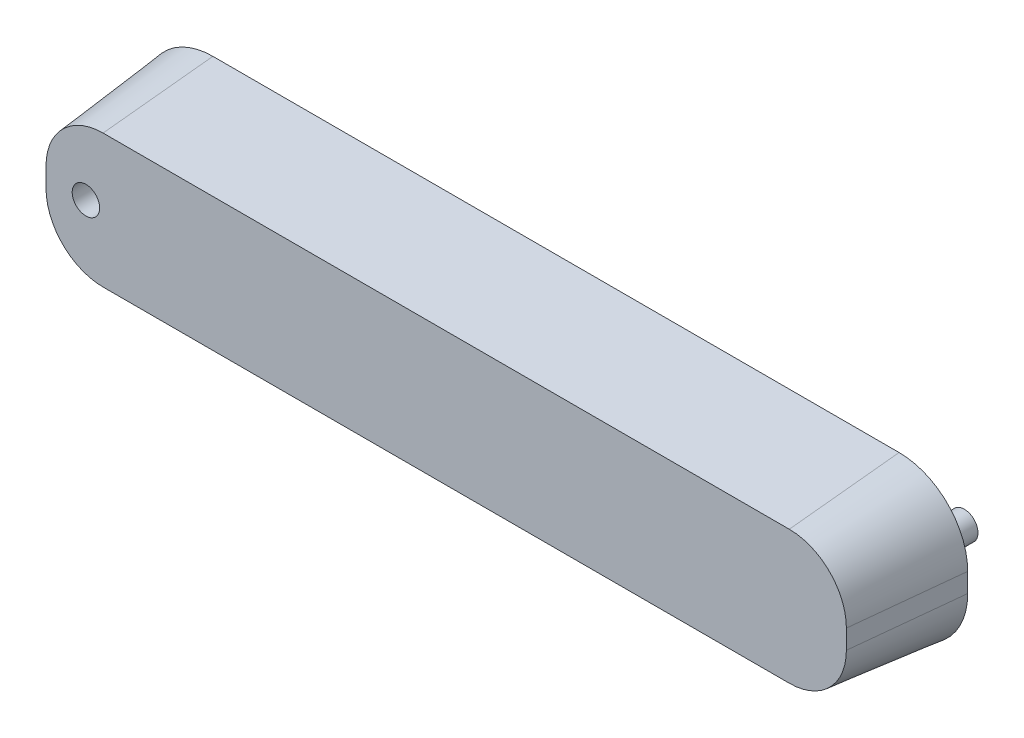
ISO-10303-21;
HEADER;
FILE_DESCRIPTION(('STEP AP214'),'2;1');
FILE_NAME('part.step','',(''),(''),'','','');
FILE_SCHEMA(('AUTOMOTIVE_DESIGN { 1 0 10303 214 1 1 1 1 }'));
ENDSEC;
DATA;
#1=APPLICATION_CONTEXT('core data for automotive mechanical design processes');
#2=APPLICATION_PROTOCOL_DEFINITION('international standard','automotive_design',2000,#1);
#3=PRODUCT_CONTEXT('',#1,'mechanical');
#4=PRODUCT('Part','Part','',(#3));
#5=PRODUCT_RELATED_PRODUCT_CATEGORY('part','',(#4));
#6=PRODUCT_DEFINITION_FORMATION('','',#4);
#7=PRODUCT_DEFINITION_CONTEXT('part definition',#1,'design');
#8=PRODUCT_DEFINITION('design','',#6,#7);
#9=PRODUCT_DEFINITION_SHAPE('','',#8);
#10=(LENGTH_UNIT() NAMED_UNIT(*) SI_UNIT(.MILLI.,.METRE.));
#11=(NAMED_UNIT(*) PLANE_ANGLE_UNIT() SI_UNIT($,.RADIAN.));
#12=(NAMED_UNIT(*) SI_UNIT($,.STERADIAN.) SOLID_ANGLE_UNIT());
#13=UNCERTAINTY_MEASURE_WITH_UNIT(LENGTH_MEASURE(1.E-05),#10,'distance_accuracy_value','');
#14=(GEOMETRIC_REPRESENTATION_CONTEXT(3) GLOBAL_UNCERTAINTY_ASSIGNED_CONTEXT((#13)) GLOBAL_UNIT_ASSIGNED_CONTEXT((#10,
#11,#12)) REPRESENTATION_CONTEXT('',''));
#15=CARTESIAN_POINT('',(0.,0.,0.));
#16=DIRECTION('',(0.,0.,1.));
#17=DIRECTION('',(1.,0.,0.));
#18=AXIS2_PLACEMENT_3D('',#15,#16,#17);
#19=CARTESIAN_POINT('',(12.5000000000005,6.99999999999983,0.));
#20=DIRECTION('',(0.,0.,-1.));
#21=DIRECTION('',(0.,-1.,0.));
#22=AXIS2_PLACEMENT_3D('',#19,#20,#21);
#23=CONICAL_SURFACE('',#22,50.,0.10471975511966);
#24=CARTESIAN_POINT('',(12.5000000000005,6.99999999999983,0.));
#25=DIRECTION('',(0.,0.,1.));
#26=DIRECTION('',(0.,-1.,0.));
#27=AXIS2_PLACEMENT_3D('',#24,#25,#26);
#28=CIRCLE('',#27,50.);
#29=CARTESIAN_POINT('',(12.5000000000008,56.9999999999998,1.99014436314058E-13));
#30=VERTEX_POINT('',#29);
#31=CARTESIAN_POINT('',(-37.4999999999995,6.99999999999938,0.));
#32=VERTEX_POINT('',#31);
#33=EDGE_CURVE('E107',#30,#32,#28,.T.);
#34=ORIENTED_EDGE('',*,*,#33,.T.);
#35=DIRECTION('',(-0.104528463267653,0.,-0.994521895368273));
#36=VECTOR('',#35,1.);
#37=CARTESIAN_POINT('',(-37.4999999999995,6.99999999999938,0.));
#38=LINE('',#37,#36);
#39=CARTESIAN_POINT('',(-29.0916611787453,6.9999999999991,80.));
#40=VERTEX_POINT('',#39);
#41=EDGE_CURVE('E42',#40,#32,#38,.T.);
#42=ORIENTED_EDGE('',*,*,#41,.F.);
#43=CARTESIAN_POINT('',(12.5000000000005,6.99999999999955,80.));
#44=DIRECTION('',(0.,0.,1.));
#45=DIRECTION('',(0.,-1.,0.));
#46=AXIS2_PLACEMENT_3D('',#43,#44,#45);
#47=CIRCLE('',#46,41.5916611787459);
#48=CARTESIAN_POINT('',(12.5000000000008,48.5916611787454,80.0000000000002));
#49=VERTEX_POINT('',#48);
#50=EDGE_CURVE('E141',#49,#40,#47,.T.);
#51=ORIENTED_EDGE('',*,*,#50,.F.);
#52=DIRECTION('',(0.,0.104528463267657,-0.994521895368273));
#53=VECTOR('',#52,1.);
#54=CARTESIAN_POINT('',(12.5000000000008,56.9999999999998,1.98293097732075E-13));
#55=LINE('',#54,#53);
#56=EDGE_CURVE('E49',#49,#30,#55,.T.);
#57=ORIENTED_EDGE('',*,*,#56,.T.);
#58=EDGE_LOOP('',(#34,#42,#51,#57));
#59=FACE_BOUND('',#58,.T.);
#60=ADVANCED_FACE('F34',(#59),#23,.T.);
#61=CARTESIAN_POINT('',(-37.4999999999995,6.99999999999938,0.));
#62=DIRECTION('',(-0.994521895368273,0.,0.104528463267653));
#63=DIRECTION('',(-0.104528463267654,0.,-0.994521895368274));
#64=AXIS2_PLACEMENT_3D('',#61,#62,#63);
#65=PLANE('',#64);
#66=DIRECTION('',(0.,-1.,0.));
#67=VECTOR('',#66,1.);
#68=CARTESIAN_POINT('',(-37.4999999999995,6.99999999999938,0.));
#69=LINE('',#68,#67);
#70=CARTESIAN_POINT('',(-37.4999999999995,-6.99999999999977,0.));
#71=VERTEX_POINT('',#70);
#72=EDGE_CURVE('E102',#32,#71,#69,.T.);
#73=ORIENTED_EDGE('',*,*,#72,.T.);
#74=DIRECTION('',(-0.104528463267653,0.,-0.994521895368273));
#75=VECTOR('',#74,1.);
#76=CARTESIAN_POINT('',(-37.4999999999995,-6.99999999999977,0.));
#77=LINE('',#76,#75);
#78=CARTESIAN_POINT('',(-29.0916611787453,-7.0000000000001,80.));
#79=VERTEX_POINT('',#78);
#80=EDGE_CURVE('E118',#79,#71,#77,.T.);
#81=ORIENTED_EDGE('',*,*,#80,.F.);
#82=DIRECTION('',(0.,1.,0.));
#83=VECTOR('',#82,1.);
#84=CARTESIAN_POINT('',(-29.0916611787453,6.9999999999991,80.));
#85=LINE('',#84,#83);
#86=EDGE_CURVE('E115',#40,#79,#85,.F.);
#87=ORIENTED_EDGE('',*,*,#86,.F.);
#88=ORIENTED_EDGE('',*,*,#41,.T.);
#89=EDGE_LOOP('',(#73,#81,#87,#88));
#90=FACE_BOUND('',#89,.T.);
#91=ADVANCED_FACE('F36',(#90),#65,.T.);
#92=CARTESIAN_POINT('',(12.5000000000006,-7.00000000000005,0.));
#93=DIRECTION('',(0.,0.,-1.));
#94=DIRECTION('',(0.,-1.,0.));
#95=AXIS2_PLACEMENT_3D('',#92,#93,#94);
#96=CONICAL_SURFACE('',#95,50.,0.10471975511966);
#97=CARTESIAN_POINT('',(12.5000000000006,-7.00000000000005,0.));
#98=DIRECTION('',(0.,0.,1.));
#99=DIRECTION('',(0.,-1.,0.));
#100=AXIS2_PLACEMENT_3D('',#97,#98,#99);
#101=CIRCLE('',#100,50.);
#102=CARTESIAN_POINT('',(12.5000000000009,-57.,-1.99014436314059E-13));
#103=VERTEX_POINT('',#102);
#104=EDGE_CURVE('E109',#71,#103,#101,.T.);
#105=ORIENTED_EDGE('',*,*,#104,.T.);
#106=DIRECTION('',(0.,-0.10452846326765,-0.994521895368274));
#107=VECTOR('',#106,1.);
#108=CARTESIAN_POINT('',(12.5000000000009,-57.,-1.99014436314059E-13));
#109=LINE('',#108,#107);
#110=CARTESIAN_POINT('',(12.5000000000009,-48.5916611787462,79.9999999999998));
#111=VERTEX_POINT('',#110);
#112=EDGE_CURVE('E153',#111,#103,#109,.T.);
#113=ORIENTED_EDGE('',*,*,#112,.F.);
#114=CARTESIAN_POINT('',(12.5000000000006,-7.00000000000033,80.));
#115=DIRECTION('',(0.,0.,1.));
#116=DIRECTION('',(0.,-1.,0.));
#117=AXIS2_PLACEMENT_3D('',#114,#115,#116);
#118=CIRCLE('',#117,41.5916611787459);
#119=EDGE_CURVE('E159',#79,#111,#118,.T.);
#120=ORIENTED_EDGE('',*,*,#119,.F.);
#121=ORIENTED_EDGE('',*,*,#80,.T.);
#122=EDGE_LOOP('',(#105,#113,#120,#121));
#123=FACE_BOUND('',#122,.T.);
#124=ADVANCED_FACE('F174',(#123),#96,.T.);
#125=CARTESIAN_POINT('',(12.5000000000009,-57.,-1.99014436314059E-13));
#126=DIRECTION('',(0.,-0.994521895368274,0.10452846326765));
#127=DIRECTION('',(0.,-0.10452846326765,-0.994521895368274));
#128=AXIS2_PLACEMENT_3D('',#125,#126,#127);
#129=PLANE('',#128);
#130=DIRECTION('',(1.,0.,0.));
#131=VECTOR('',#130,1.);
#132=CARTESIAN_POINT('',(12.5000000000009,-57.,-1.99014436314059E-13));
#133=LINE('',#132,#131);
#134=CARTESIAN_POINT('',(512.5,-57.,-1.99014436314059E-13));
#135=VERTEX_POINT('',#134);
#136=EDGE_CURVE('E128',#103,#135,#133,.T.);
#137=ORIENTED_EDGE('',*,*,#136,.T.);
#138=DIRECTION('',(0.,-0.10452846326765,-0.994521895368274));
#139=VECTOR('',#138,1.);
#140=CARTESIAN_POINT('',(512.5,-57.,-1.99014436314059E-13));
#141=LINE('',#140,#139);
#142=CARTESIAN_POINT('',(512.5,-48.5916611787462,79.9999999999998));
#143=VERTEX_POINT('',#142);
#144=EDGE_CURVE('E151',#143,#135,#141,.T.);
#145=ORIENTED_EDGE('',*,*,#144,.F.);
#146=DIRECTION('',(-1.,0.,0.));
#147=VECTOR('',#146,1.);
#148=CARTESIAN_POINT('',(12.5000000000009,-48.5916611787462,79.9999999999998));
#149=LINE('',#148,#147);
#150=EDGE_CURVE('E161',#111,#143,#149,.F.);
#151=ORIENTED_EDGE('',*,*,#150,.F.);
#152=ORIENTED_EDGE('',*,*,#112,.T.);
#153=EDGE_LOOP('',(#137,#145,#151,#152));
#154=FACE_BOUND('',#153,.T.);
#155=ADVANCED_FACE('F178',(#154),#129,.T.);
#156=CARTESIAN_POINT('',(512.5,-7.00000000000006,0.));
#157=DIRECTION('',(0.,0.,-1.));
#158=DIRECTION('',(0.,1.,0.));
#159=AXIS2_PLACEMENT_3D('',#156,#157,#158);
#160=CONICAL_SURFACE('',#159,50.,0.10471975511966);
#161=CARTESIAN_POINT('',(512.5,-7.00000000000006,0.));
#162=DIRECTION('',(0.,0.,-1.));
#163=DIRECTION('',(0.,1.,0.));
#164=AXIS2_PLACEMENT_3D('',#161,#162,#163);
#165=CIRCLE('',#164,50.);
#166=CARTESIAN_POINT('',(562.5,-6.99999999999969,0.));
#167=VERTEX_POINT('',#166);
#168=EDGE_CURVE('E131',#167,#135,#165,.T.);
#169=ORIENTED_EDGE('',*,*,#168,.F.);
#170=DIRECTION('',(0.104528463267653,0.,-0.994521895368273));
#171=VECTOR('',#170,1.);
#172=CARTESIAN_POINT('',(562.5,-6.9999999999997,0.));
#173=LINE('',#172,#171);
#174=CARTESIAN_POINT('',(554.091661178746,-6.99999999999998,80.));
#175=VERTEX_POINT('',#174);
#176=EDGE_CURVE('E149',#175,#167,#173,.T.);
#177=ORIENTED_EDGE('',*,*,#176,.F.);
#178=CARTESIAN_POINT('',(512.5,-7.00000000000033,80.));
#179=DIRECTION('',(0.,0.,1.));
#180=DIRECTION('',(0.,-1.,0.));
#181=AXIS2_PLACEMENT_3D('',#178,#179,#180);
#182=CIRCLE('',#181,41.5916611787459);
#183=EDGE_CURVE('E163',#175,#143,#182,.F.);
#184=ORIENTED_EDGE('',*,*,#183,.T.);
#185=ORIENTED_EDGE('',*,*,#144,.T.);
#186=EDGE_LOOP('',(#169,#177,#184,#185));
#187=FACE_BOUND('',#186,.T.);
#188=ADVANCED_FACE('F188',(#187),#160,.T.);
#189=CARTESIAN_POINT('',(562.5,6.99999999999947,0.));
#190=DIRECTION('',(0.994521895368273,0.,0.104528463267653));
#191=DIRECTION('',(-0.104528463267654,0.,0.994521895368274));
#192=AXIS2_PLACEMENT_3D('',#189,#190,#191);
#193=PLANE('',#192);
#194=DIRECTION('',(0.,-1.,0.));
#195=VECTOR('',#194,1.);
#196=CARTESIAN_POINT('',(562.5,6.99999999999947,0.));
#197=LINE('',#196,#195);
#198=CARTESIAN_POINT('',(562.5,6.99999999999947,0.));
#199=VERTEX_POINT('',#198);
#200=EDGE_CURVE('E134',#199,#167,#197,.T.);
#201=ORIENTED_EDGE('',*,*,#200,.F.);
#202=DIRECTION('',(0.104528463267653,0.,-0.994521895368273));
#203=VECTOR('',#202,1.);
#204=CARTESIAN_POINT('',(562.5,6.99999999999949,0.));
#205=LINE('',#204,#203);
#206=CARTESIAN_POINT('',(554.091661178746,6.99999999999927,80.));
#207=VERTEX_POINT('',#206);
#208=EDGE_CURVE('E147',#207,#199,#205,.T.);
#209=ORIENTED_EDGE('',*,*,#208,.F.);
#210=DIRECTION('',(0.,-1.,0.));
#211=VECTOR('',#210,1.);
#212=CARTESIAN_POINT('',(554.091661178746,6.99999999999919,80.));
#213=LINE('',#212,#211);
#214=EDGE_CURVE('E166',#207,#175,#213,.T.);
#215=ORIENTED_EDGE('',*,*,#214,.T.);
#216=ORIENTED_EDGE('',*,*,#176,.T.);
#217=EDGE_LOOP('',(#201,#209,#215,#216));
#218=FACE_BOUND('',#217,.T.);
#219=ADVANCED_FACE('F183',(#218),#193,.T.);
#220=CARTESIAN_POINT('',(512.5,6.99999999999983,0.));
#221=DIRECTION('',(0.,0.,-1.));
#222=DIRECTION('',(0.,-1.,0.));
#223=AXIS2_PLACEMENT_3D('',#220,#221,#222);
#224=CONICAL_SURFACE('',#223,50.,0.10471975511966);
#225=CARTESIAN_POINT('',(512.5,6.99999999999983,0.));
#226=DIRECTION('',(0.,0.,1.));
#227=DIRECTION('',(0.,-1.,0.));
#228=AXIS2_PLACEMENT_3D('',#225,#226,#227);
#229=CIRCLE('',#228,50.);
#230=CARTESIAN_POINT('',(512.5,56.9999999999998,1.99014436314058E-13));
#231=VERTEX_POINT('',#230);
#232=EDGE_CURVE('E137',#199,#231,#229,.T.);
#233=ORIENTED_EDGE('',*,*,#232,.T.);
#234=DIRECTION('',(0.,0.104528463267657,-0.994521895368273));
#235=VECTOR('',#234,1.);
#236=CARTESIAN_POINT('',(512.5,56.9999999999998,1.99014436314058E-13));
#237=LINE('',#236,#235);
#238=CARTESIAN_POINT('',(512.5,48.5916611787454,80.0000000000002));
#239=VERTEX_POINT('',#238);
#240=EDGE_CURVE('E144',#239,#231,#237,.T.);
#241=ORIENTED_EDGE('',*,*,#240,.F.);
#242=CARTESIAN_POINT('',(512.5,6.99999999999955,80.));
#243=DIRECTION('',(0.,0.,1.));
#244=DIRECTION('',(0.,-1.,0.));
#245=AXIS2_PLACEMENT_3D('',#242,#243,#244);
#246=CIRCLE('',#245,41.5916611787459);
#247=EDGE_CURVE('E57',#207,#239,#246,.T.);
#248=ORIENTED_EDGE('',*,*,#247,.F.);
#249=ORIENTED_EDGE('',*,*,#208,.T.);
#250=EDGE_LOOP('',(#233,#241,#248,#249));
#251=FACE_BOUND('',#250,.T.);
#252=ADVANCED_FACE('F187',(#251),#224,.T.);
#253=CARTESIAN_POINT('',(12.5000000000008,56.9999999999998,1.99014436314058E-13));
#254=DIRECTION('',(0.,0.994521895368273,0.104528463267657));
#255=DIRECTION('',(0.,-0.104528463267657,0.994521895368273));
#256=AXIS2_PLACEMENT_3D('',#253,#254,#255);
#257=PLANE('',#256);
#258=DIRECTION('',(1.,0.,0.));
#259=VECTOR('',#258,1.);
#260=CARTESIAN_POINT('',(12.5000000000008,56.9999999999998,1.99014436314058E-13));
#261=LINE('',#260,#259);
#262=EDGE_CURVE('E140',#30,#231,#261,.T.);
#263=ORIENTED_EDGE('',*,*,#262,.F.);
#264=ORIENTED_EDGE('',*,*,#56,.F.);
#265=DIRECTION('',(1.,0.,0.));
#266=VECTOR('',#265,1.);
#267=CARTESIAN_POINT('',(12.5000000000008,48.5916611787454,80.0000000000002));
#268=LINE('',#267,#266);
#269=EDGE_CURVE('E145',#49,#239,#268,.T.);
#270=ORIENTED_EDGE('',*,*,#269,.T.);
#271=ORIENTED_EDGE('',*,*,#240,.T.);
#272=EDGE_LOOP('',(#263,#264,#270,#271));
#273=FACE_BOUND('',#272,.T.);
#274=ADVANCED_FACE('F169',(#273),#257,.T.);
#275=CARTESIAN_POINT('',(12.5000000000005,6.99999999999955,80.));
#276=DIRECTION('',(0.,0.,1.));
#277=DIRECTION('',(0.,-1.,0.));
#278=AXIS2_PLACEMENT_3D('',#275,#276,#277);
#279=PLANE('',#278);
#280=CARTESIAN_POINT('',(0.,-2.79318507107451E-13,80.));
#281=DIRECTION('',(0.,0.,1.));
#282=DIRECTION('',(0.,-1.,0.));
#283=AXIS2_PLACEMENT_3D('',#280,#281,#282);
#284=CIRCLE('',#283,10.);
#285=CARTESIAN_POINT('',(0.,-10.0000000000003,80.));
#286=VERTEX_POINT('',#285);
#287=EDGE_CURVE('E337',#286,#286,#284,.T.);
#288=ORIENTED_EDGE('',*,*,#287,.F.);
#289=EDGE_LOOP('',(#288));
#290=FACE_BOUND('',#289,.T.);
#291=ORIENTED_EDGE('',*,*,#50,.T.);
#292=ORIENTED_EDGE('',*,*,#86,.T.);
#293=ORIENTED_EDGE('',*,*,#119,.T.);
#294=ORIENTED_EDGE('',*,*,#150,.T.);
#295=ORIENTED_EDGE('',*,*,#183,.F.);
#296=ORIENTED_EDGE('',*,*,#214,.F.);
#297=ORIENTED_EDGE('',*,*,#247,.T.);
#298=ORIENTED_EDGE('',*,*,#269,.F.);
#299=EDGE_LOOP('',(#291,#292,#293,#294,#295,#296,#297,#298));
#300=FACE_BOUND('',#299,.T.);
#301=ADVANCED_FACE('F170',(#290,#300),#279,.T.);
#302=CARTESIAN_POINT('',(12.5000000000005,6.99999999999983,0.));
#303=DIRECTION('',(0.,0.,1.));
#304=DIRECTION('',(0.,-1.,0.));
#305=AXIS2_PLACEMENT_3D('',#302,#303,#304);
#306=PLANE('',#305);
#307=CARTESIAN_POINT('',(525.,0.,0.));
#308=DIRECTION('',(0.,0.,1.));
#309=DIRECTION('',(0.,-1.,0.));
#310=AXIS2_PLACEMENT_3D('',#307,#308,#309);
#311=CIRCLE('',#310,10.);
#312=CARTESIAN_POINT('',(525.,-10.,0.));
#313=VERTEX_POINT('',#312);
#314=EDGE_CURVE('E11',#313,#313,#311,.F.);
#315=ORIENTED_EDGE('',*,*,#314,.F.);
#316=EDGE_LOOP('',(#315));
#317=FACE_BOUND('',#316,.T.);
#318=ORIENTED_EDGE('',*,*,#33,.F.);
#319=ORIENTED_EDGE('',*,*,#262,.T.);
#320=ORIENTED_EDGE('',*,*,#232,.F.);
#321=ORIENTED_EDGE('',*,*,#200,.T.);
#322=ORIENTED_EDGE('',*,*,#168,.T.);
#323=ORIENTED_EDGE('',*,*,#136,.F.);
#324=ORIENTED_EDGE('',*,*,#104,.F.);
#325=ORIENTED_EDGE('',*,*,#72,.F.);
#326=EDGE_LOOP('',(#318,#319,#320,#321,#322,#323,#324,#325));
#327=FACE_BOUND('',#326,.T.);
#328=ADVANCED_FACE('F104',(#317,#327),#306,.F.);
#329=CARTESIAN_POINT('',(525.,1.2220184685951E-13,-35.));
#330=DIRECTION('',(0.,0.,1.));
#331=DIRECTION('',(0.,-1.,0.));
#332=AXIS2_PLACEMENT_3D('',#329,#330,#331);
#333=CYLINDRICAL_SURFACE('',#332,10.);
#334=CARTESIAN_POINT('',(525.,1.2220184685951E-13,-35.));
#335=DIRECTION('',(0.,0.,-1.));
#336=DIRECTION('',(0.,1.,0.));
#337=AXIS2_PLACEMENT_3D('',#334,#335,#336);
#338=CIRCLE('',#337,10.);
#339=CARTESIAN_POINT('',(525.,10.0000000000002,-35.));
#340=VERTEX_POINT('',#339);
#341=EDGE_CURVE('E120',#340,#340,#338,.T.);
#342=ORIENTED_EDGE('',*,*,#341,.F.);
#343=EDGE_LOOP('',(#342));
#344=FACE_BOUND('',#343,.T.);
#345=ORIENTED_EDGE('',*,*,#314,.T.);
#346=EDGE_LOOP('',(#345));
#347=FACE_BOUND('',#346,.T.);
#348=ADVANCED_FACE('F231',(#344,#347),#333,.T.);
#349=CARTESIAN_POINT('',(525.,1.2220184685951E-13,-35.));
#350=DIRECTION('',(0.,0.,-1.));
#351=DIRECTION('',(0.,1.,0.));
#352=AXIS2_PLACEMENT_3D('',#349,#350,#351);
#353=PLANE('',#352);
#354=ORIENTED_EDGE('',*,*,#341,.T.);
#355=EDGE_LOOP('',(#354));
#356=FACE_BOUND('',#355,.T.);
#357=ADVANCED_FACE('F239',(#356),#353,.T.);
#358=CARTESIAN_POINT('',(0.,-1.74574066942157E-13,50.));
#359=DIRECTION('',(0.,0.,1.));
#360=DIRECTION('',(0.,-1.,0.));
#361=AXIS2_PLACEMENT_3D('',#358,#359,#360);
#362=CYLINDRICAL_SURFACE('',#361,10.);
#363=CARTESIAN_POINT('',(0.,-1.74574066942157E-13,50.));
#364=DIRECTION('',(0.,0.,1.));
#365=DIRECTION('',(0.,-1.,0.));
#366=AXIS2_PLACEMENT_3D('',#363,#364,#365);
#367=CIRCLE('',#366,10.);
#368=CARTESIAN_POINT('',(0.,-10.0000000000002,50.));
#369=VERTEX_POINT('',#368);
#370=EDGE_CURVE('E123',#369,#369,#367,.T.);
#371=ORIENTED_EDGE('',*,*,#370,.F.);
#372=EDGE_LOOP('',(#371));
#373=FACE_BOUND('',#372,.T.);
#374=ORIENTED_EDGE('',*,*,#287,.T.);
#375=EDGE_LOOP('',(#374));
#376=FACE_BOUND('',#375,.T.);
#377=ADVANCED_FACE('F247',(#373,#376),#362,.F.);
#378=CARTESIAN_POINT('',(0.,-1.74574066942157E-13,50.));
#379=DIRECTION('',(0.,0.,1.));
#380=DIRECTION('',(0.,-1.,0.));
#381=AXIS2_PLACEMENT_3D('',#378,#379,#380);
#382=PLANE('',#381);
#383=ORIENTED_EDGE('',*,*,#370,.T.);
#384=EDGE_LOOP('',(#383));
#385=FACE_BOUND('',#384,.T.);
#386=ADVANCED_FACE('F254',(#385),#382,.T.);
#387=CLOSED_SHELL('',(#60,#91,#124,#155,#188,#219,#252,#274,#301,#328,#348,#357,#377,#386));
#388=MANIFOLD_SOLID_BREP('B2',#387);
#389=ADVANCED_BREP_SHAPE_REPRESENTATION('',(#18,#388),#14);
#390=SHAPE_DEFINITION_REPRESENTATION(#9,#389);
ENDSEC;
END-ISO-10303-21;
